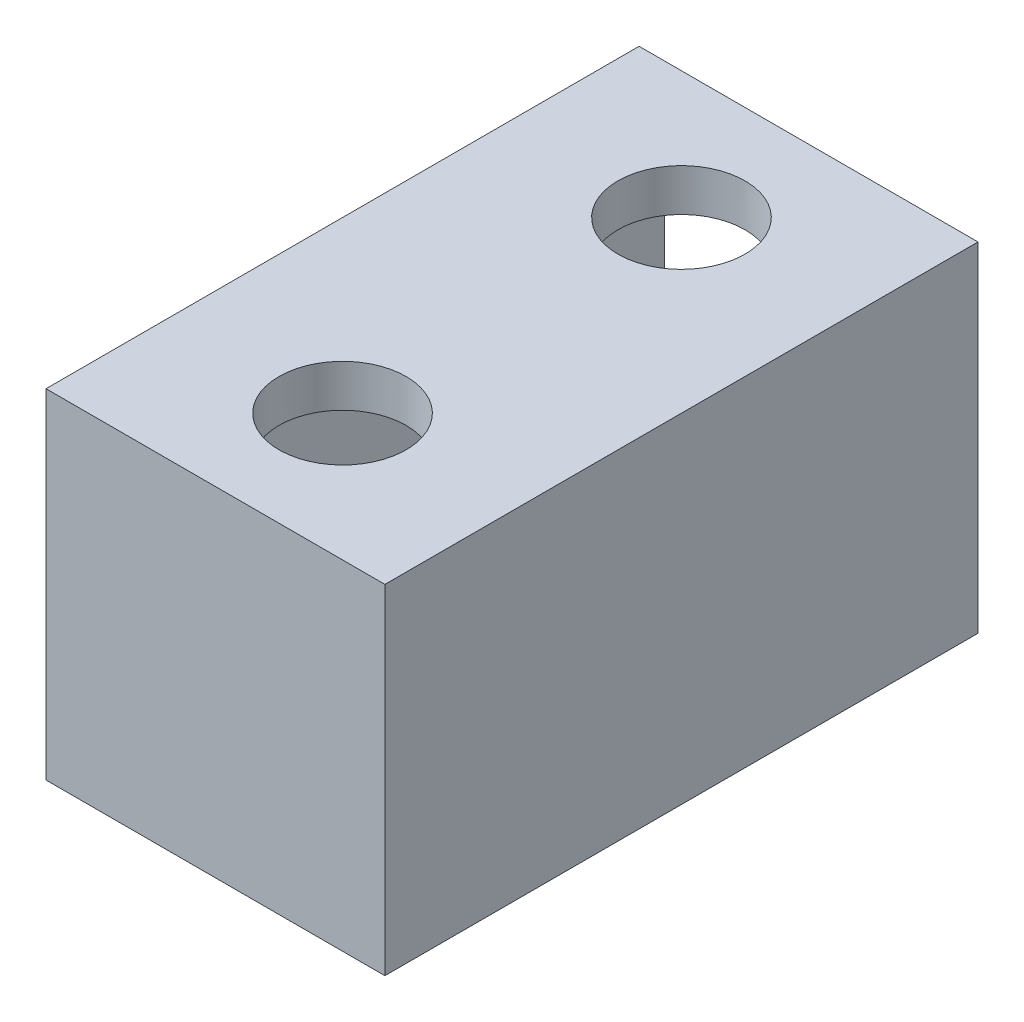
ISO-10303-21;
HEADER;
FILE_DESCRIPTION(('STEP AP214'),'2;1');
FILE_NAME('part.step','',(''),(''),'','','');
FILE_SCHEMA(('AUTOMOTIVE_DESIGN { 1 0 10303 214 1 1 1 1 }'));
ENDSEC;
DATA;
#1=APPLICATION_CONTEXT('core data for automotive mechanical design processes');
#2=APPLICATION_PROTOCOL_DEFINITION('international standard','automotive_design',2000,#1);
#3=PRODUCT_CONTEXT('',#1,'mechanical');
#4=PRODUCT('Part','Part','',(#3));
#5=PRODUCT_RELATED_PRODUCT_CATEGORY('part','',(#4));
#6=PRODUCT_DEFINITION_FORMATION('','',#4);
#7=PRODUCT_DEFINITION_CONTEXT('part definition',#1,'design');
#8=PRODUCT_DEFINITION('design','',#6,#7);
#9=PRODUCT_DEFINITION_SHAPE('','',#8);
#10=(LENGTH_UNIT() NAMED_UNIT(*) SI_UNIT(.MILLI.,.METRE.));
#11=(NAMED_UNIT(*) PLANE_ANGLE_UNIT() SI_UNIT($,.RADIAN.));
#12=(NAMED_UNIT(*) SI_UNIT($,.STERADIAN.) SOLID_ANGLE_UNIT());
#13=UNCERTAINTY_MEASURE_WITH_UNIT(LENGTH_MEASURE(1.E-05),#10,'distance_accuracy_value','');
#14=(GEOMETRIC_REPRESENTATION_CONTEXT(3) GLOBAL_UNCERTAINTY_ASSIGNED_CONTEXT((#13)) GLOBAL_UNIT_ASSIGNED_CONTEXT((#10,
#11,#12)) REPRESENTATION_CONTEXT('',''));
#15=CARTESIAN_POINT('',(0.,0.,0.));
#16=DIRECTION('',(0.,0.,1.));
#17=DIRECTION('',(1.,0.,0.));
#18=AXIS2_PLACEMENT_3D('',#15,#16,#17);
#19=CARTESIAN_POINT('',(-37.,37.,70.));
#20=DIRECTION('',(0.,-1.,0.));
#21=DIRECTION('',(0.,0.,-1.));
#22=AXIS2_PLACEMENT_3D('',#19,#20,#21);
#23=PLANE('',#22);
#24=CARTESIAN_POINT('',(-20.,37.,15.));
#25=DIRECTION('',(0.,-1.,0.));
#26=DIRECTION('',(0.,0.,-1.));
#27=AXIS2_PLACEMENT_3D('',#24,#25,#26);
#28=CIRCLE('',#27,8.5);
#29=CARTESIAN_POINT('',(-20.,37.,6.50000000000001));
#30=VERTEX_POINT('',#29);
#31=EDGE_CURVE('E225',#30,#30,#28,.T.);
#32=ORIENTED_EDGE('',*,*,#31,.F.);
#33=EDGE_LOOP('',(#32));
#34=FACE_BOUND('',#33,.T.);
#35=DIRECTION('',(0.,0.,-1.));
#36=VECTOR('',#35,1.);
#37=CARTESIAN_POINT('',(-3.,37.,70.));
#38=LINE('',#37,#36);
#39=CARTESIAN_POINT('',(-3.,37.,67.));
#40=VERTEX_POINT('',#39);
#41=CARTESIAN_POINT('',(-3.,37.,0.));
#42=VERTEX_POINT('',#41);
#43=EDGE_CURVE('E260',#40,#42,#38,.T.);
#44=ORIENTED_EDGE('',*,*,#43,.F.);
#45=DIRECTION('',(1.,0.,0.));
#46=VECTOR('',#45,1.);
#47=CARTESIAN_POINT('',(-3.,37.,67.));
#48=LINE('',#47,#46);
#49=CARTESIAN_POINT('',(-37.,37.,67.));
#50=VERTEX_POINT('',#49);
#51=EDGE_CURVE('E235',#50,#40,#48,.T.);
#52=ORIENTED_EDGE('',*,*,#51,.F.);
#53=DIRECTION('',(0.,0.,-1.));
#54=VECTOR('',#53,1.);
#55=CARTESIAN_POINT('',(-37.,37.,70.));
#56=LINE('',#55,#54);
#57=CARTESIAN_POINT('',(-37.,37.,0.));
#58=VERTEX_POINT('',#57);
#59=EDGE_CURVE('E258',#50,#58,#56,.T.);
#60=ORIENTED_EDGE('',*,*,#59,.T.);
#61=DIRECTION('',(-1.,0.,0.));
#62=VECTOR('',#61,1.);
#63=CARTESIAN_POINT('',(-37.,37.,0.));
#64=LINE('',#63,#62);
#65=EDGE_CURVE('E255',#42,#58,#64,.T.);
#66=ORIENTED_EDGE('',*,*,#65,.F.);
#67=EDGE_LOOP('',(#44,#52,#60,#66));
#68=FACE_BOUND('',#67,.T.);
#69=CARTESIAN_POINT('',(-20.,37.,55.));
#70=DIRECTION('',(0.,-1.,0.));
#71=DIRECTION('',(0.,0.,-1.));
#72=AXIS2_PLACEMENT_3D('',#69,#70,#71);
#73=CIRCLE('',#72,8.5);
#74=CARTESIAN_POINT('',(-20.,37.,46.5));
#75=VERTEX_POINT('',#74);
#76=EDGE_CURVE('E216',#75,#75,#73,.T.);
#77=ORIENTED_EDGE('',*,*,#76,.F.);
#78=EDGE_LOOP('',(#77));
#79=FACE_BOUND('',#78,.T.);
#80=ADVANCED_FACE('F41',(#34,#68,#79),#23,.T.);
#81=CARTESIAN_POINT('',(-37.,37.,70.));
#82=DIRECTION('',(1.,0.,0.));
#83=DIRECTION('',(0.,1.,0.));
#84=AXIS2_PLACEMENT_3D('',#81,#82,#83);
#85=PLANE('',#84);
#86=ORIENTED_EDGE('',*,*,#59,.F.);
#87=DIRECTION('',(0.,1.,0.));
#88=VECTOR('',#87,1.);
#89=CARTESIAN_POINT('',(-37.,0.,67.));
#90=LINE('',#89,#88);
#91=CARTESIAN_POINT('',(-37.,3.,67.));
#92=VERTEX_POINT('',#91);
#93=EDGE_CURVE('E64',#92,#50,#90,.T.);
#94=ORIENTED_EDGE('',*,*,#93,.F.);
#95=DIRECTION('',(0.,0.,-1.));
#96=VECTOR('',#95,1.);
#97=CARTESIAN_POINT('',(-37.,3.,70.));
#98=LINE('',#97,#96);
#99=CARTESIAN_POINT('',(-37.,3.,0.));
#100=VERTEX_POINT('',#99);
#101=EDGE_CURVE('E264',#92,#100,#98,.T.);
#102=ORIENTED_EDGE('',*,*,#101,.T.);
#103=DIRECTION('',(0.,-1.,0.));
#104=VECTOR('',#103,1.);
#105=CARTESIAN_POINT('',(-37.,37.,0.));
#106=LINE('',#105,#104);
#107=EDGE_CURVE('E246',#58,#100,#106,.T.);
#108=ORIENTED_EDGE('',*,*,#107,.F.);
#109=EDGE_LOOP('',(#86,#94,#102,#108));
#110=FACE_BOUND('',#109,.T.);
#111=ADVANCED_FACE('F332',(#110),#85,.T.);
#112=CARTESIAN_POINT('',(-37.,3.,70.));
#113=DIRECTION('',(0.,1.,0.));
#114=DIRECTION('',(0.,0.,1.));
#115=AXIS2_PLACEMENT_3D('',#112,#113,#114);
#116=PLANE('',#115);
#117=ORIENTED_EDGE('',*,*,#101,.F.);
#118=DIRECTION('',(1.,0.,0.));
#119=VECTOR('',#118,1.);
#120=CARTESIAN_POINT('',(-37.,3.,67.));
#121=LINE('',#120,#119);
#122=CARTESIAN_POINT('',(-3.,3.,67.));
#123=VERTEX_POINT('',#122);
#124=EDGE_CURVE('E243',#92,#123,#121,.T.);
#125=ORIENTED_EDGE('',*,*,#124,.T.);
#126=DIRECTION('',(0.,0.,-1.));
#127=VECTOR('',#126,1.);
#128=CARTESIAN_POINT('',(-3.,3.,70.));
#129=LINE('',#128,#127);
#130=CARTESIAN_POINT('',(-3.,3.,0.));
#131=VERTEX_POINT('',#130);
#132=EDGE_CURVE('E262',#123,#131,#129,.T.);
#133=ORIENTED_EDGE('',*,*,#132,.T.);
#134=DIRECTION('',(1.,0.,0.));
#135=VECTOR('',#134,1.);
#136=CARTESIAN_POINT('',(-37.,3.,0.));
#137=LINE('',#136,#135);
#138=EDGE_CURVE('E249',#100,#131,#137,.T.);
#139=ORIENTED_EDGE('',*,*,#138,.F.);
#140=EDGE_LOOP('',(#117,#125,#133,#139));
#141=FACE_BOUND('',#140,.T.);
#142=ADVANCED_FACE('F338',(#141),#116,.T.);
#143=CARTESIAN_POINT('',(-3.,37.,70.));
#144=DIRECTION('',(-1.,0.,0.));
#145=DIRECTION('',(0.,-1.,0.));
#146=AXIS2_PLACEMENT_3D('',#143,#144,#145);
#147=PLANE('',#146);
#148=ORIENTED_EDGE('',*,*,#132,.F.);
#149=DIRECTION('',(0.,1.,0.));
#150=VECTOR('',#149,1.);
#151=CARTESIAN_POINT('',(-3.,0.,67.));
#152=LINE('',#151,#150);
#153=EDGE_CURVE('E239',#123,#40,#152,.T.);
#154=ORIENTED_EDGE('',*,*,#153,.T.);
#155=ORIENTED_EDGE('',*,*,#43,.T.);
#156=DIRECTION('',(0.,1.,0.));
#157=VECTOR('',#156,1.);
#158=CARTESIAN_POINT('',(-3.,37.,0.));
#159=LINE('',#158,#157);
#160=EDGE_CURVE('E252',#131,#42,#159,.T.);
#161=ORIENTED_EDGE('',*,*,#160,.F.);
#162=EDGE_LOOP('',(#148,#154,#155,#161));
#163=FACE_BOUND('',#162,.T.);
#164=ADVANCED_FACE('F347',(#163),#147,.T.);
#165=CARTESIAN_POINT('',(0.,0.,70.));
#166=DIRECTION('',(0.,0.,1.));
#167=DIRECTION('',(1.,0.,0.));
#168=AXIS2_PLACEMENT_3D('',#165,#166,#167);
#169=PLANE('',#168);
#170=DIRECTION('',(1.,0.,0.));
#171=VECTOR('',#170,1.);
#172=CARTESIAN_POINT('',(0.,0.,70.));
#173=LINE('',#172,#171);
#174=CARTESIAN_POINT('',(-40.,0.,70.));
#175=VERTEX_POINT('',#174);
#176=CARTESIAN_POINT('',(0.,0.,70.));
#177=VERTEX_POINT('',#176);
#178=EDGE_CURVE('E275',#175,#177,#173,.T.);
#179=ORIENTED_EDGE('',*,*,#178,.T.);
#180=DIRECTION('',(0.,1.,0.));
#181=VECTOR('',#180,1.);
#182=CARTESIAN_POINT('',(0.,0.,70.));
#183=LINE('',#182,#181);
#184=CARTESIAN_POINT('',(0.,40.,70.));
#185=VERTEX_POINT('',#184);
#186=EDGE_CURVE('E267',#177,#185,#183,.T.);
#187=ORIENTED_EDGE('',*,*,#186,.T.);
#188=DIRECTION('',(-1.,0.,0.));
#189=VECTOR('',#188,1.);
#190=CARTESIAN_POINT('',(0.,40.,70.));
#191=LINE('',#190,#189);
#192=CARTESIAN_POINT('',(-40.,40.,70.));
#193=VERTEX_POINT('',#192);
#194=EDGE_CURVE('E270',#185,#193,#191,.T.);
#195=ORIENTED_EDGE('',*,*,#194,.T.);
#196=DIRECTION('',(0.,-1.,0.));
#197=VECTOR('',#196,1.);
#198=CARTESIAN_POINT('',(-40.,0.,70.));
#199=LINE('',#198,#197);
#200=EDGE_CURVE('E273',#193,#175,#199,.T.);
#201=ORIENTED_EDGE('',*,*,#200,.T.);
#202=EDGE_LOOP('',(#179,#187,#195,#201));
#203=FACE_BOUND('',#202,.T.);
#204=ADVANCED_FACE('F350',(#203),#169,.T.);
#205=CARTESIAN_POINT('',(0.,0.,0.));
#206=DIRECTION('',(0.,0.,1.));
#207=DIRECTION('',(1.,0.,0.));
#208=AXIS2_PLACEMENT_3D('',#205,#206,#207);
#209=PLANE('',#208);
#210=DIRECTION('',(0.,1.,0.));
#211=VECTOR('',#210,1.);
#212=CARTESIAN_POINT('',(0.,0.,0.));
#213=LINE('',#212,#211);
#214=CARTESIAN_POINT('',(0.,0.,0.));
#215=VERTEX_POINT('',#214);
#216=CARTESIAN_POINT('',(0.,40.,0.));
#217=VERTEX_POINT('',#216);
#218=EDGE_CURVE('E266',#215,#217,#213,.T.);
#219=ORIENTED_EDGE('',*,*,#218,.F.);
#220=DIRECTION('',(1.,0.,0.));
#221=VECTOR('',#220,1.);
#222=CARTESIAN_POINT('',(0.,0.,0.));
#223=LINE('',#222,#221);
#224=CARTESIAN_POINT('',(-40.,0.,0.));
#225=VERTEX_POINT('',#224);
#226=EDGE_CURVE('E271',#225,#215,#223,.T.);
#227=ORIENTED_EDGE('',*,*,#226,.F.);
#228=DIRECTION('',(0.,-1.,0.));
#229=VECTOR('',#228,1.);
#230=CARTESIAN_POINT('',(-40.,0.,0.));
#231=LINE('',#230,#229);
#232=CARTESIAN_POINT('',(-40.,40.,0.));
#233=VERTEX_POINT('',#232);
#234=EDGE_CURVE('E282',#233,#225,#231,.T.);
#235=ORIENTED_EDGE('',*,*,#234,.F.);
#236=DIRECTION('',(-1.,0.,0.));
#237=VECTOR('',#236,1.);
#238=CARTESIAN_POINT('',(0.,40.,0.));
#239=LINE('',#238,#237);
#240=EDGE_CURVE('E280',#217,#233,#239,.T.);
#241=ORIENTED_EDGE('',*,*,#240,.F.);
#242=EDGE_LOOP('',(#219,#227,#235,#241));
#243=FACE_BOUND('',#242,.T.);
#244=ORIENTED_EDGE('',*,*,#107,.T.);
#245=ORIENTED_EDGE('',*,*,#138,.T.);
#246=ORIENTED_EDGE('',*,*,#160,.T.);
#247=ORIENTED_EDGE('',*,*,#65,.T.);
#248=EDGE_LOOP('',(#244,#245,#246,#247));
#249=FACE_BOUND('',#248,.T.);
#250=ADVANCED_FACE('F357',(#243,#249),#209,.F.);
#251=CARTESIAN_POINT('',(0.,0.,70.));
#252=DIRECTION('',(-1.,0.,0.));
#253=DIRECTION('',(0.,0.,1.));
#254=AXIS2_PLACEMENT_3D('',#251,#252,#253);
#255=PLANE('',#254);
#256=ORIENTED_EDGE('',*,*,#218,.T.);
#257=DIRECTION('',(0.,0.,-1.));
#258=VECTOR('',#257,1.);
#259=CARTESIAN_POINT('',(0.,40.,70.));
#260=LINE('',#259,#258);
#261=EDGE_CURVE('E293',#185,#217,#260,.T.);
#262=ORIENTED_EDGE('',*,*,#261,.F.);
#263=ORIENTED_EDGE('',*,*,#186,.F.);
#264=DIRECTION('',(0.,0.,-1.));
#265=VECTOR('',#264,1.);
#266=CARTESIAN_POINT('',(0.,0.,70.));
#267=LINE('',#266,#265);
#268=EDGE_CURVE('E277',#177,#215,#267,.T.);
#269=ORIENTED_EDGE('',*,*,#268,.T.);
#270=EDGE_LOOP('',(#256,#262,#263,#269));
#271=FACE_BOUND('',#270,.T.);
#272=ADVANCED_FACE('F361',(#271),#255,.F.);
#273=CARTESIAN_POINT('',(0.,40.,70.));
#274=DIRECTION('',(0.,-1.,0.));
#275=DIRECTION('',(1.,0.,0.));
#276=AXIS2_PLACEMENT_3D('',#273,#274,#275);
#277=PLANE('',#276);
#278=CARTESIAN_POINT('',(-20.,40.,15.));
#279=DIRECTION('',(0.,1.,0.));
#280=DIRECTION('',(-1.,0.,0.));
#281=AXIS2_PLACEMENT_3D('',#278,#279,#280);
#282=CIRCLE('',#281,7.5);
#283=CARTESIAN_POINT('',(-27.5,40.,15.));
#284=VERTEX_POINT('',#283);
#285=EDGE_CURVE('E232',#284,#284,#282,.T.);
#286=ORIENTED_EDGE('',*,*,#285,.F.);
#287=EDGE_LOOP('',(#286));
#288=FACE_BOUND('',#287,.T.);
#289=CARTESIAN_POINT('',(-20.,40.,55.));
#290=DIRECTION('',(0.,1.,0.));
#291=DIRECTION('',(-1.,0.,0.));
#292=AXIS2_PLACEMENT_3D('',#289,#290,#291);
#293=CIRCLE('',#292,7.5);
#294=CARTESIAN_POINT('',(-27.5,40.,55.));
#295=VERTEX_POINT('',#294);
#296=EDGE_CURVE('E229',#295,#295,#293,.T.);
#297=ORIENTED_EDGE('',*,*,#296,.F.);
#298=EDGE_LOOP('',(#297));
#299=FACE_BOUND('',#298,.T.);
#300=ORIENTED_EDGE('',*,*,#240,.T.);
#301=DIRECTION('',(0.,0.,-1.));
#302=VECTOR('',#301,1.);
#303=CARTESIAN_POINT('',(-40.,40.,70.));
#304=LINE('',#303,#302);
#305=EDGE_CURVE('E290',#193,#233,#304,.T.);
#306=ORIENTED_EDGE('',*,*,#305,.F.);
#307=ORIENTED_EDGE('',*,*,#194,.F.);
#308=ORIENTED_EDGE('',*,*,#261,.T.);
#309=EDGE_LOOP('',(#300,#306,#307,#308));
#310=FACE_BOUND('',#309,.T.);
#311=ADVANCED_FACE('F368',(#288,#299,#310),#277,.F.);
#312=CARTESIAN_POINT('',(-40.,0.,70.));
#313=DIRECTION('',(1.,0.,0.));
#314=DIRECTION('',(0.,0.,-1.));
#315=AXIS2_PLACEMENT_3D('',#312,#313,#314);
#316=PLANE('',#315);
#317=DIRECTION('',(0.,0.,-1.));
#318=VECTOR('',#317,1.);
#319=CARTESIAN_POINT('',(-40.,12.2656638650946,36.2326811808479));
#320=LINE('',#319,#318);
#321=CARTESIAN_POINT('',(-40.,12.2656638650946,36.2326811808479));
#322=VERTEX_POINT('',#321);
#323=CARTESIAN_POINT('',(-40.,12.2656638650946,33.4122512443855));
#324=VERTEX_POINT('',#323);
#325=EDGE_CURVE('E174',#322,#324,#320,.T.);
#326=ORIENTED_EDGE('',*,*,#325,.T.);
#327=DIRECTION('',(0.,1.,0.));
#328=VECTOR('',#327,1.);
#329=CARTESIAN_POINT('',(-40.,12.2656638650946,33.4122512443855));
#330=LINE('',#329,#328);
#331=CARTESIAN_POINT('',(-40.,28.0228014676535,33.4122512443855));
#332=VERTEX_POINT('',#331);
#333=EDGE_CURVE('E191',#324,#332,#330,.T.);
#334=ORIENTED_EDGE('',*,*,#333,.T.);
#335=DIRECTION('',(0.,0.,-1.));
#336=VECTOR('',#335,1.);
#337=CARTESIAN_POINT('',(-40.,28.0228014676535,33.4122512443855));
#338=LINE('',#337,#336);
#339=CARTESIAN_POINT('',(-40.,28.0228014676535,32.5346376383043));
#340=VERTEX_POINT('',#339);
#341=EDGE_CURVE('E153',#332,#340,#338,.T.);
#342=ORIENTED_EDGE('',*,*,#341,.T.);
#343=DIRECTION('',(0.,0.707106781186555,0.70710678118654));
#344=VECTOR('',#343,1.);
#345=CARTESIAN_POINT('',(-40.,28.0228014676535,32.5346376383043));
#346=LINE('',#345,#344);
#347=CARTESIAN_POINT('',(-40.,30.4881638293493,35.));
#348=VERTEX_POINT('',#347);
#349=EDGE_CURVE('E56',#340,#348,#346,.T.);
#350=ORIENTED_EDGE('',*,*,#349,.T.);
#351=DIRECTION('',(0.,-0.707106781186539,0.707106781186556));
#352=VECTOR('',#351,1.);
#353=CARTESIAN_POINT('',(-40.,30.4881638293493,35.));
#354=LINE('',#353,#352);
#355=CARTESIAN_POINT('',(-40.,28.0228014676535,37.4653623616958));
#356=VERTEX_POINT('',#355);
#357=EDGE_CURVE('E195',#348,#356,#354,.T.);
#358=ORIENTED_EDGE('',*,*,#357,.T.);
#359=DIRECTION('',(0.,0.,-1.));
#360=VECTOR('',#359,1.);
#361=CARTESIAN_POINT('',(-40.,28.0228014676535,37.4653623616958));
#362=LINE('',#361,#360);
#363=CARTESIAN_POINT('',(-40.,28.0228014676535,36.2326811808479));
#364=VERTEX_POINT('',#363);
#365=EDGE_CURVE('E198',#356,#364,#362,.T.);
#366=ORIENTED_EDGE('',*,*,#365,.T.);
#367=DIRECTION('',(0.,-1.,0.));
#368=VECTOR('',#367,1.);
#369=CARTESIAN_POINT('',(-40.,28.0228014676535,36.2326811808479));
#370=LINE('',#369,#368);
#371=EDGE_CURVE('E177',#364,#322,#370,.T.);
#372=ORIENTED_EDGE('',*,*,#371,.T.);
#373=EDGE_LOOP('',(#326,#334,#342,#350,#358,#366,#372));
#374=FACE_BOUND('',#373,.T.);
#375=ORIENTED_EDGE('',*,*,#234,.T.);
#376=DIRECTION('',(0.,0.,-1.));
#377=VECTOR('',#376,1.);
#378=CARTESIAN_POINT('',(-40.,0.,70.));
#379=LINE('',#378,#377);
#380=EDGE_CURVE('E287',#175,#225,#379,.T.);
#381=ORIENTED_EDGE('',*,*,#380,.F.);
#382=ORIENTED_EDGE('',*,*,#200,.F.);
#383=ORIENTED_EDGE('',*,*,#305,.T.);
#384=EDGE_LOOP('',(#375,#381,#382,#383));
#385=FACE_BOUND('',#384,.T.);
#386=ADVANCED_FACE('F365',(#374,#385),#316,.F.);
#387=CARTESIAN_POINT('',(0.,0.,70.));
#388=DIRECTION('',(0.,1.,0.));
#389=DIRECTION('',(-1.,0.,0.));
#390=AXIS2_PLACEMENT_3D('',#387,#388,#389);
#391=PLANE('',#390);
#392=CARTESIAN_POINT('',(-20.,0.,55.));
#393=DIRECTION('',(0.,1.,0.));
#394=DIRECTION('',(-1.,0.,0.));
#395=AXIS2_PLACEMENT_3D('',#392,#393,#394);
#396=CIRCLE('',#395,9.);
#397=CARTESIAN_POINT('',(-29.,0.,55.));
#398=VERTEX_POINT('',#397);
#399=EDGE_CURVE('E49',#398,#398,#396,.T.);
#400=ORIENTED_EDGE('',*,*,#399,.T.);
#401=EDGE_LOOP('',(#400));
#402=FACE_BOUND('',#401,.T.);
#403=CARTESIAN_POINT('',(-20.,0.,15.));
#404=DIRECTION('',(0.,1.,0.));
#405=DIRECTION('',(-1.,0.,0.));
#406=AXIS2_PLACEMENT_3D('',#403,#404,#405);
#407=CIRCLE('',#406,9.);
#408=CARTESIAN_POINT('',(-29.,0.,15.));
#409=VERTEX_POINT('',#408);
#410=EDGE_CURVE('E308',#409,#409,#407,.T.);
#411=ORIENTED_EDGE('',*,*,#410,.T.);
#412=EDGE_LOOP('',(#411));
#413=FACE_BOUND('',#412,.T.);
#414=ORIENTED_EDGE('',*,*,#268,.F.);
#415=ORIENTED_EDGE('',*,*,#178,.F.);
#416=ORIENTED_EDGE('',*,*,#380,.T.);
#417=ORIENTED_EDGE('',*,*,#226,.T.);
#418=EDGE_LOOP('',(#414,#415,#416,#417));
#419=FACE_BOUND('',#418,.T.);
#420=ADVANCED_FACE('F316',(#402,#413,#419),#391,.F.);
#421=CARTESIAN_POINT('',(-3.,0.,67.));
#422=DIRECTION('',(0.,0.,1.));
#423=DIRECTION('',(1.,0.,0.));
#424=AXIS2_PLACEMENT_3D('',#421,#422,#423);
#425=PLANE('',#424);
#426=ORIENTED_EDGE('',*,*,#124,.F.);
#427=ORIENTED_EDGE('',*,*,#93,.T.);
#428=ORIENTED_EDGE('',*,*,#51,.T.);
#429=ORIENTED_EDGE('',*,*,#153,.F.);
#430=EDGE_LOOP('',(#426,#427,#428,#429));
#431=FACE_BOUND('',#430,.T.);
#432=ADVANCED_FACE('F345',(#431),#425,.F.);
#433=CARTESIAN_POINT('',(-20.,3.,55.));
#434=DIRECTION('',(0.,1.,0.));
#435=DIRECTION('',(-1.,0.,0.));
#436=AXIS2_PLACEMENT_3D('',#433,#434,#435);
#437=CYLINDRICAL_SURFACE('',#436,7.5);
#438=ORIENTED_EDGE('',*,*,#296,.T.);
#439=EDGE_LOOP('',(#438));
#440=FACE_BOUND('',#439,.T.);
#441=CARTESIAN_POINT('',(-20.,35.,55.));
#442=DIRECTION('',(0.,-1.,0.));
#443=DIRECTION('',(0.,0.,-1.));
#444=AXIS2_PLACEMENT_3D('',#441,#442,#443);
#445=CIRCLE('',#444,7.5);
#446=CARTESIAN_POINT('',(-20.,35.,47.5));
#447=VERTEX_POINT('',#446);
#448=EDGE_CURVE('E204',#447,#447,#445,.T.);
#449=ORIENTED_EDGE('',*,*,#448,.T.);
#450=EDGE_LOOP('',(#449));
#451=FACE_BOUND('',#450,.T.);
#452=ADVANCED_FACE('F420',(#440,#451),#437,.F.);
#453=CARTESIAN_POINT('',(-20.,3.,15.));
#454=DIRECTION('',(0.,1.,0.));
#455=DIRECTION('',(-1.,0.,0.));
#456=AXIS2_PLACEMENT_3D('',#453,#454,#455);
#457=CYLINDRICAL_SURFACE('',#456,7.5);
#458=ORIENTED_EDGE('',*,*,#285,.T.);
#459=EDGE_LOOP('',(#458));
#460=FACE_BOUND('',#459,.T.);
#461=CARTESIAN_POINT('',(-20.,35.,15.));
#462=DIRECTION('',(0.,-1.,0.));
#463=DIRECTION('',(0.,0.,-1.));
#464=AXIS2_PLACEMENT_3D('',#461,#462,#463);
#465=CIRCLE('',#464,7.5);
#466=CARTESIAN_POINT('',(-20.,35.,7.50000000000001));
#467=VERTEX_POINT('',#466);
#468=EDGE_CURVE('E220',#467,#467,#465,.T.);
#469=ORIENTED_EDGE('',*,*,#468,.T.);
#470=EDGE_LOOP('',(#469));
#471=FACE_BOUND('',#470,.T.);
#472=ADVANCED_FACE('F414',(#460,#471),#457,.F.);
#473=CARTESIAN_POINT('',(-20.,35.,15.));
#474=DIRECTION('',(0.,-1.,0.));
#475=DIRECTION('',(0.,0.,-1.));
#476=AXIS2_PLACEMENT_3D('',#473,#474,#475);
#477=PLANE('',#476);
#478=CARTESIAN_POINT('',(-20.,35.,15.));
#479=DIRECTION('',(0.,-1.,0.));
#480=DIRECTION('',(0.,0.,-1.));
#481=AXIS2_PLACEMENT_3D('',#478,#479,#480);
#482=CIRCLE('',#481,8.5);
#483=CARTESIAN_POINT('',(-20.,35.,6.50000000000001));
#484=VERTEX_POINT('',#483);
#485=EDGE_CURVE('E226',#484,#484,#482,.T.);
#486=ORIENTED_EDGE('',*,*,#485,.T.);
#487=EDGE_LOOP('',(#486));
#488=FACE_BOUND('',#487,.T.);
#489=ORIENTED_EDGE('',*,*,#468,.F.);
#490=EDGE_LOOP('',(#489));
#491=FACE_BOUND('',#490,.T.);
#492=ADVANCED_FACE('F411',(#488,#491),#477,.T.);
#493=CARTESIAN_POINT('',(-20.,35.,15.));
#494=DIRECTION('',(0.,1.,0.));
#495=DIRECTION('',(0.,0.,1.));
#496=AXIS2_PLACEMENT_3D('',#493,#494,#495);
#497=CYLINDRICAL_SURFACE('',#496,8.5);
#498=ORIENTED_EDGE('',*,*,#485,.F.);
#499=EDGE_LOOP('',(#498));
#500=FACE_BOUND('',#499,.T.);
#501=ORIENTED_EDGE('',*,*,#31,.T.);
#502=EDGE_LOOP('',(#501));
#503=FACE_BOUND('',#502,.T.);
#504=ADVANCED_FACE('F408',(#500,#503),#497,.T.);
#505=CARTESIAN_POINT('',(-20.,35.,55.));
#506=DIRECTION('',(0.,-1.,0.));
#507=DIRECTION('',(0.,0.,-1.));
#508=AXIS2_PLACEMENT_3D('',#505,#506,#507);
#509=PLANE('',#508);
#510=CARTESIAN_POINT('',(-20.,35.,55.));
#511=DIRECTION('',(0.,-1.,0.));
#512=DIRECTION('',(0.,0.,-1.));
#513=AXIS2_PLACEMENT_3D('',#510,#511,#512);
#514=CIRCLE('',#513,8.5);
#515=CARTESIAN_POINT('',(-20.,35.,46.5));
#516=VERTEX_POINT('',#515);
#517=EDGE_CURVE('E217',#516,#516,#514,.T.);
#518=ORIENTED_EDGE('',*,*,#517,.T.);
#519=EDGE_LOOP('',(#518));
#520=FACE_BOUND('',#519,.T.);
#521=ORIENTED_EDGE('',*,*,#448,.F.);
#522=EDGE_LOOP('',(#521));
#523=FACE_BOUND('',#522,.T.);
#524=ADVANCED_FACE('F402',(#520,#523),#509,.T.);
#525=CARTESIAN_POINT('',(-20.,35.,55.));
#526=DIRECTION('',(0.,1.,0.));
#527=DIRECTION('',(0.,0.,1.));
#528=AXIS2_PLACEMENT_3D('',#525,#526,#527);
#529=CYLINDRICAL_SURFACE('',#528,8.5);
#530=ORIENTED_EDGE('',*,*,#517,.F.);
#531=EDGE_LOOP('',(#530));
#532=FACE_BOUND('',#531,.T.);
#533=ORIENTED_EDGE('',*,*,#76,.T.);
#534=EDGE_LOOP('',(#533));
#535=FACE_BOUND('',#534,.T.);
#536=ADVANCED_FACE('F392',(#532,#535),#529,.T.);
#537=CARTESIAN_POINT('',(-20.,-7.,15.));
#538=DIRECTION('',(0.,1.,0.));
#539=DIRECTION('',(0.,0.,1.));
#540=AXIS2_PLACEMENT_3D('',#537,#538,#539);
#541=CYLINDRICAL_SURFACE('',#540,7.5);
#542=CARTESIAN_POINT('',(-20.,-1.5,15.));
#543=DIRECTION('',(0.,1.,0.));
#544=DIRECTION('',(-1.,0.,0.));
#545=AXIS2_PLACEMENT_3D('',#542,#543,#544);
#546=CIRCLE('',#545,7.5);
#547=CARTESIAN_POINT('',(-27.5,-1.5,15.));
#548=VERTEX_POINT('',#547);
#549=EDGE_CURVE('E311',#548,#548,#546,.F.);
#550=ORIENTED_EDGE('',*,*,#549,.T.);
#551=EDGE_LOOP('',(#550));
#552=FACE_BOUND('',#551,.T.);
#553=CARTESIAN_POINT('',(-20.,-5.50000000000001,15.));
#554=DIRECTION('',(0.,1.,0.));
#555=DIRECTION('',(0.,0.,1.));
#556=AXIS2_PLACEMENT_3D('',#553,#554,#555);
#557=CIRCLE('',#556,7.5);
#558=CARTESIAN_POINT('',(-20.,-5.50000000000001,22.5));
#559=VERTEX_POINT('',#558);
#560=EDGE_CURVE('E302',#559,#559,#557,.T.);
#561=ORIENTED_EDGE('',*,*,#560,.T.);
#562=EDGE_LOOP('',(#561));
#563=FACE_BOUND('',#562,.T.);
#564=ADVANCED_FACE('F389',(#552,#563),#541,.T.);
#565=CARTESIAN_POINT('',(-20.,-7.,15.));
#566=DIRECTION('',(0.,1.,0.));
#567=DIRECTION('',(0.,0.,1.));
#568=AXIS2_PLACEMENT_3D('',#565,#566,#567);
#569=PLANE('',#568);
#570=CARTESIAN_POINT('',(-20.,-7.,15.));
#571=DIRECTION('',(0.,1.,0.));
#572=DIRECTION('',(0.,0.,1.));
#573=AXIS2_PLACEMENT_3D('',#570,#571,#572);
#574=CIRCLE('',#573,6.);
#575=CARTESIAN_POINT('',(-20.,-7.,21.));
#576=VERTEX_POINT('',#575);
#577=EDGE_CURVE('E305',#576,#576,#574,.F.);
#578=ORIENTED_EDGE('',*,*,#577,.T.);
#579=EDGE_LOOP('',(#578));
#580=FACE_BOUND('',#579,.T.);
#581=ADVANCED_FACE('F391',(#580),#569,.F.);
#582=CARTESIAN_POINT('',(-20.,-7.,55.));
#583=DIRECTION('',(0.,1.,0.));
#584=DIRECTION('',(0.,0.,1.));
#585=AXIS2_PLACEMENT_3D('',#582,#583,#584);
#586=CYLINDRICAL_SURFACE('',#585,7.5);
#587=CARTESIAN_POINT('',(-20.,-1.5,55.));
#588=DIRECTION('',(0.,1.,0.));
#589=DIRECTION('',(-1.,0.,0.));
#590=AXIS2_PLACEMENT_3D('',#587,#588,#589);
#591=CIRCLE('',#590,7.5);
#592=CARTESIAN_POINT('',(-27.5,-1.5,55.));
#593=VERTEX_POINT('',#592);
#594=EDGE_CURVE('E11',#593,#593,#591,.F.);
#595=ORIENTED_EDGE('',*,*,#594,.T.);
#596=EDGE_LOOP('',(#595));
#597=FACE_BOUND('',#596,.T.);
#598=CARTESIAN_POINT('',(-20.,-5.50000000000001,55.));
#599=DIRECTION('',(0.,1.,0.));
#600=DIRECTION('',(0.,0.,1.));
#601=AXIS2_PLACEMENT_3D('',#598,#599,#600);
#602=CIRCLE('',#601,7.5);
#603=CARTESIAN_POINT('',(-20.,-5.50000000000001,62.5));
#604=VERTEX_POINT('',#603);
#605=EDGE_CURVE('E296',#604,#604,#602,.T.);
#606=ORIENTED_EDGE('',*,*,#605,.T.);
#607=EDGE_LOOP('',(#606));
#608=FACE_BOUND('',#607,.T.);
#609=ADVANCED_FACE('F399',(#597,#608),#586,.T.);
#610=CARTESIAN_POINT('',(-20.,-7.,55.));
#611=DIRECTION('',(0.,1.,0.));
#612=DIRECTION('',(0.,0.,1.));
#613=AXIS2_PLACEMENT_3D('',#610,#611,#612);
#614=PLANE('',#613);
#615=CARTESIAN_POINT('',(-20.,-7.,55.));
#616=DIRECTION('',(0.,1.,0.));
#617=DIRECTION('',(0.,0.,1.));
#618=AXIS2_PLACEMENT_3D('',#615,#616,#617);
#619=CIRCLE('',#618,6.);
#620=CARTESIAN_POINT('',(-20.,-7.,61.));
#621=VERTEX_POINT('',#620);
#622=EDGE_CURVE('E299',#621,#621,#619,.F.);
#623=ORIENTED_EDGE('',*,*,#622,.T.);
#624=EDGE_LOOP('',(#623));
#625=FACE_BOUND('',#624,.T.);
#626=ADVANCED_FACE('F379',(#625),#614,.F.);
#627=CARTESIAN_POINT('',(-20.,-5.50000000000001,55.));
#628=DIRECTION('',(0.,1.,0.));
#629=DIRECTION('',(0.,0.,1.));
#630=AXIS2_PLACEMENT_3D('',#627,#628,#629);
#631=TOROIDAL_SURFACE('',#630,6.,1.5);
#632=ORIENTED_EDGE('',*,*,#622,.F.);
#633=EDGE_LOOP('',(#632));
#634=FACE_BOUND('',#633,.T.);
#635=ORIENTED_EDGE('',*,*,#605,.F.);
#636=EDGE_LOOP('',(#635));
#637=FACE_BOUND('',#636,.T.);
#638=ADVANCED_FACE('F376',(#634,#637),#631,.T.);
#639=CARTESIAN_POINT('',(-20.,-5.50000000000001,15.));
#640=DIRECTION('',(0.,1.,0.));
#641=DIRECTION('',(0.,0.,1.));
#642=AXIS2_PLACEMENT_3D('',#639,#640,#641);
#643=TOROIDAL_SURFACE('',#642,6.,1.5);
#644=ORIENTED_EDGE('',*,*,#577,.F.);
#645=EDGE_LOOP('',(#644));
#646=FACE_BOUND('',#645,.T.);
#647=ORIENTED_EDGE('',*,*,#560,.F.);
#648=EDGE_LOOP('',(#647));
#649=FACE_BOUND('',#648,.T.);
#650=ADVANCED_FACE('F328',(#646,#649),#643,.T.);
#651=CARTESIAN_POINT('',(-20.,-1.5,15.));
#652=DIRECTION('',(0.,1.,0.));
#653=DIRECTION('',(-1.,0.,0.));
#654=AXIS2_PLACEMENT_3D('',#651,#652,#653);
#655=TOROIDAL_SURFACE('',#654,9.,1.5);
#656=ORIENTED_EDGE('',*,*,#549,.F.);
#657=EDGE_LOOP('',(#656));
#658=FACE_BOUND('',#657,.T.);
#659=ORIENTED_EDGE('',*,*,#410,.F.);
#660=EDGE_LOOP('',(#659));
#661=FACE_BOUND('',#660,.T.);
#662=ADVANCED_FACE('F320',(#658,#661),#655,.F.);
#663=CARTESIAN_POINT('',(-20.,-1.5,55.));
#664=DIRECTION('',(0.,1.,0.));
#665=DIRECTION('',(-1.,0.,0.));
#666=AXIS2_PLACEMENT_3D('',#663,#664,#665);
#667=TOROIDAL_SURFACE('',#666,9.,1.5);
#668=ORIENTED_EDGE('',*,*,#594,.F.);
#669=EDGE_LOOP('',(#668));
#670=FACE_BOUND('',#669,.T.);
#671=ORIENTED_EDGE('',*,*,#399,.F.);
#672=EDGE_LOOP('',(#671));
#673=FACE_BOUND('',#672,.T.);
#674=ADVANCED_FACE('F43',(#670,#673),#667,.F.);
#675=CARTESIAN_POINT('',(-42.,12.2656638650946,33.4122512443855));
#676=DIRECTION('',(0.,0.,-1.));
#677=DIRECTION('',(-1.,0.,0.));
#678=AXIS2_PLACEMENT_3D('',#675,#676,#677);
#679=PLANE('',#678);
#680=ORIENTED_EDGE('',*,*,#333,.F.);
#681=DIRECTION('',(1.,0.,0.));
#682=VECTOR('',#681,1.);
#683=CARTESIAN_POINT('',(-42.,12.2656638650946,33.4122512443855));
#684=LINE('',#683,#682);
#685=CARTESIAN_POINT('',(-42.,12.2656638650946,33.4122512443855));
#686=VERTEX_POINT('',#685);
#687=EDGE_CURVE('E173',#686,#324,#684,.T.);
#688=ORIENTED_EDGE('',*,*,#687,.F.);
#689=DIRECTION('',(0.,1.,0.));
#690=VECTOR('',#689,1.);
#691=CARTESIAN_POINT('',(-42.,12.2656638650946,33.4122512443855));
#692=LINE('',#691,#690);
#693=CARTESIAN_POINT('',(-42.,28.0228014676535,33.4122512443855));
#694=VERTEX_POINT('',#693);
#695=EDGE_CURVE('E166',#686,#694,#692,.T.);
#696=ORIENTED_EDGE('',*,*,#695,.T.);
#697=DIRECTION('',(1.,0.,0.));
#698=VECTOR('',#697,1.);
#699=CARTESIAN_POINT('',(-42.,28.0228014676535,33.4122512443855));
#700=LINE('',#699,#698);
#701=EDGE_CURVE('E148',#694,#332,#700,.T.);
#702=ORIENTED_EDGE('',*,*,#701,.T.);
#703=EDGE_LOOP('',(#680,#688,#696,#702));
#704=FACE_BOUND('',#703,.T.);
#705=ADVANCED_FACE('F172',(#704),#679,.T.);
#706=CARTESIAN_POINT('',(-42.,12.2656638650946,36.2326811808479));
#707=DIRECTION('',(0.,-1.,0.));
#708=DIRECTION('',(0.,0.,-1.));
#709=AXIS2_PLACEMENT_3D('',#706,#707,#708);
#710=PLANE('',#709);
#711=ORIENTED_EDGE('',*,*,#325,.F.);
#712=DIRECTION('',(1.,0.,0.));
#713=VECTOR('',#712,1.);
#714=CARTESIAN_POINT('',(-42.,12.2656638650946,36.2326811808479));
#715=LINE('',#714,#713);
#716=CARTESIAN_POINT('',(-42.,12.2656638650946,36.2326811808479));
#717=VERTEX_POINT('',#716);
#718=EDGE_CURVE('E205',#717,#322,#715,.T.);
#719=ORIENTED_EDGE('',*,*,#718,.F.);
#720=DIRECTION('',(0.,0.,-1.));
#721=VECTOR('',#720,1.);
#722=CARTESIAN_POINT('',(-42.,12.2656638650946,36.2326811808479));
#723=LINE('',#722,#721);
#724=EDGE_CURVE('E159',#717,#686,#723,.T.);
#725=ORIENTED_EDGE('',*,*,#724,.T.);
#726=ORIENTED_EDGE('',*,*,#687,.T.);
#727=EDGE_LOOP('',(#711,#719,#725,#726));
#728=FACE_BOUND('',#727,.T.);
#729=ADVANCED_FACE('F326',(#728),#710,.T.);
#730=CARTESIAN_POINT('',(-42.,28.0228014676535,36.2326811808479));
#731=DIRECTION('',(0.,0.,1.));
#732=DIRECTION('',(1.,0.,0.));
#733=AXIS2_PLACEMENT_3D('',#730,#731,#732);
#734=PLANE('',#733);
#735=ORIENTED_EDGE('',*,*,#371,.F.);
#736=DIRECTION('',(1.,0.,0.));
#737=VECTOR('',#736,1.);
#738=CARTESIAN_POINT('',(-42.,28.0228014676535,36.2326811808479));
#739=LINE('',#738,#737);
#740=CARTESIAN_POINT('',(-42.,28.0228014676535,36.2326811808479));
#741=VERTEX_POINT('',#740);
#742=EDGE_CURVE('E207',#741,#364,#739,.T.);
#743=ORIENTED_EDGE('',*,*,#742,.F.);
#744=DIRECTION('',(0.,-1.,0.));
#745=VECTOR('',#744,1.);
#746=CARTESIAN_POINT('',(-42.,28.0228014676535,36.2326811808479));
#747=LINE('',#746,#745);
#748=EDGE_CURVE('E187',#741,#717,#747,.T.);
#749=ORIENTED_EDGE('',*,*,#748,.T.);
#750=ORIENTED_EDGE('',*,*,#718,.T.);
#751=EDGE_LOOP('',(#735,#743,#749,#750));
#752=FACE_BOUND('',#751,.T.);
#753=ADVANCED_FACE('F552',(#752),#734,.T.);
#754=CARTESIAN_POINT('',(-42.,28.0228014676535,37.4653623616958));
#755=DIRECTION('',(0.,-1.,0.));
#756=DIRECTION('',(0.,0.,-1.));
#757=AXIS2_PLACEMENT_3D('',#754,#755,#756);
#758=PLANE('',#757);
#759=ORIENTED_EDGE('',*,*,#365,.F.);
#760=DIRECTION('',(1.,0.,0.));
#761=VECTOR('',#760,1.);
#762=CARTESIAN_POINT('',(-42.,28.0228014676535,37.4653623616958));
#763=LINE('',#762,#761);
#764=CARTESIAN_POINT('',(-42.,28.0228014676535,37.4653623616958));
#765=VERTEX_POINT('',#764);
#766=EDGE_CURVE('E209',#765,#356,#763,.T.);
#767=ORIENTED_EDGE('',*,*,#766,.F.);
#768=DIRECTION('',(0.,0.,-1.));
#769=VECTOR('',#768,1.);
#770=CARTESIAN_POINT('',(-42.,28.0228014676535,37.4653623616958));
#771=LINE('',#770,#769);
#772=EDGE_CURVE('E184',#765,#741,#771,.T.);
#773=ORIENTED_EDGE('',*,*,#772,.T.);
#774=ORIENTED_EDGE('',*,*,#742,.T.);
#775=EDGE_LOOP('',(#759,#767,#773,#774));
#776=FACE_BOUND('',#775,.T.);
#777=ADVANCED_FACE('F561',(#776),#758,.T.);
#778=CARTESIAN_POINT('',(-42.,30.4881638293493,35.));
#779=DIRECTION('',(0.,0.707106781186556,0.707106781186539));
#780=DIRECTION('',(0.,-0.707106781186539,0.707106781186556));
#781=AXIS2_PLACEMENT_3D('',#778,#779,#780);
#782=PLANE('',#781);
#783=ORIENTED_EDGE('',*,*,#357,.F.);
#784=DIRECTION('',(1.,0.,0.));
#785=VECTOR('',#784,1.);
#786=CARTESIAN_POINT('',(-42.,30.4881638293493,35.));
#787=LINE('',#786,#785);
#788=CARTESIAN_POINT('',(-42.,30.4881638293493,35.));
#789=VERTEX_POINT('',#788);
#790=EDGE_CURVE('E211',#789,#348,#787,.T.);
#791=ORIENTED_EDGE('',*,*,#790,.F.);
#792=DIRECTION('',(0.,-0.707106781186539,0.707106781186556));
#793=VECTOR('',#792,1.);
#794=CARTESIAN_POINT('',(-42.,30.4881638293493,35.));
#795=LINE('',#794,#793);
#796=EDGE_CURVE('E181',#789,#765,#795,.T.);
#797=ORIENTED_EDGE('',*,*,#796,.T.);
#798=ORIENTED_EDGE('',*,*,#766,.T.);
#799=EDGE_LOOP('',(#783,#791,#797,#798));
#800=FACE_BOUND('',#799,.T.);
#801=ADVANCED_FACE('F570',(#800),#782,.T.);
#802=CARTESIAN_POINT('',(-42.,28.0228014676535,32.5346376383043));
#803=DIRECTION('',(0.,0.70710678118654,-0.707106781186555));
#804=DIRECTION('',(0.,0.707106781186555,0.70710678118654));
#805=AXIS2_PLACEMENT_3D('',#802,#803,#804);
#806=PLANE('',#805);
#807=ORIENTED_EDGE('',*,*,#349,.F.);
#808=DIRECTION('',(1.,0.,0.));
#809=VECTOR('',#808,1.);
#810=CARTESIAN_POINT('',(-42.,28.0228014676535,32.5346376383043));
#811=LINE('',#810,#809);
#812=CARTESIAN_POINT('',(-42.,28.0228014676535,32.5346376383043));
#813=VERTEX_POINT('',#812);
#814=EDGE_CURVE('E158',#813,#340,#811,.T.);
#815=ORIENTED_EDGE('',*,*,#814,.F.);
#816=DIRECTION('',(0.,0.707106781186555,0.70710678118654));
#817=VECTOR('',#816,1.);
#818=CARTESIAN_POINT('',(-42.,28.0228014676535,32.5346376383043));
#819=LINE('',#818,#817);
#820=EDGE_CURVE('E170',#813,#789,#819,.T.);
#821=ORIENTED_EDGE('',*,*,#820,.T.);
#822=ORIENTED_EDGE('',*,*,#790,.T.);
#823=EDGE_LOOP('',(#807,#815,#821,#822));
#824=FACE_BOUND('',#823,.T.);
#825=ADVANCED_FACE('F579',(#824),#806,.T.);
#826=CARTESIAN_POINT('',(-42.,28.0228014676535,33.4122512443855));
#827=DIRECTION('',(0.,-1.,0.));
#828=DIRECTION('',(0.,0.,-1.));
#829=AXIS2_PLACEMENT_3D('',#826,#827,#828);
#830=PLANE('',#829);
#831=ORIENTED_EDGE('',*,*,#341,.F.);
#832=ORIENTED_EDGE('',*,*,#701,.F.);
#833=DIRECTION('',(0.,0.,-1.));
#834=VECTOR('',#833,1.);
#835=CARTESIAN_POINT('',(-42.,28.0228014676535,33.4122512443855));
#836=LINE('',#835,#834);
#837=EDGE_CURVE('E151',#694,#813,#836,.T.);
#838=ORIENTED_EDGE('',*,*,#837,.T.);
#839=ORIENTED_EDGE('',*,*,#814,.T.);
#840=EDGE_LOOP('',(#831,#832,#838,#839));
#841=FACE_BOUND('',#840,.T.);
#842=ADVANCED_FACE('F150',(#841),#830,.T.);
#843=CARTESIAN_POINT('',(-42.,0.,0.));
#844=DIRECTION('',(-1.,0.,0.));
#845=DIRECTION('',(0.,0.,1.));
#846=AXIS2_PLACEMENT_3D('',#843,#844,#845);
#847=PLANE('',#846);
#848=ORIENTED_EDGE('',*,*,#695,.F.);
#849=ORIENTED_EDGE('',*,*,#724,.F.);
#850=ORIENTED_EDGE('',*,*,#748,.F.);
#851=ORIENTED_EDGE('',*,*,#772,.F.);
#852=ORIENTED_EDGE('',*,*,#796,.F.);
#853=ORIENTED_EDGE('',*,*,#820,.F.);
#854=ORIENTED_EDGE('',*,*,#837,.F.);
#855=EDGE_LOOP('',(#848,#849,#850,#851,#852,#853,#854));
#856=FACE_BOUND('',#855,.T.);
#857=ADVANCED_FACE('F164',(#856),#847,.T.);
#858=CLOSED_SHELL('',(#80,#111,#142,#164,#204,#250,#272,#311,#386,#420,#432,#452,#472,#492,#504,
#524,#536,#564,#581,#609,#626,#638,#650,#662,#674,#705,#729,#753,#777,#801,#825,#842,#857));
#859=MANIFOLD_SOLID_BREP('B2',#858);
#860=ADVANCED_BREP_SHAPE_REPRESENTATION('',(#18,#859),#14);
#861=SHAPE_DEFINITION_REPRESENTATION(#9,#860);
ENDSEC;
END-ISO-10303-21;
